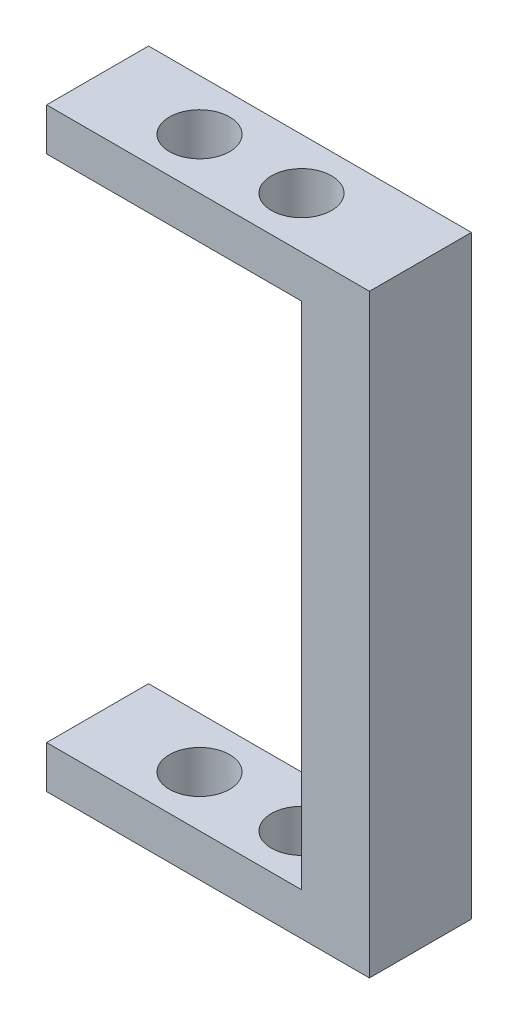
ISO-10303-21;
HEADER;
FILE_DESCRIPTION(('STEP AP214'),'2;1');
FILE_NAME('part.step','',(''),(''),'','','');
FILE_SCHEMA(('AUTOMOTIVE_DESIGN { 1 0 10303 214 1 1 1 1 }'));
ENDSEC;
DATA;
#1=APPLICATION_CONTEXT('core data for automotive mechanical design processes');
#2=APPLICATION_PROTOCOL_DEFINITION('international standard','automotive_design',2000,#1);
#3=PRODUCT_CONTEXT('',#1,'mechanical');
#4=PRODUCT('Part','Part','',(#3));
#5=PRODUCT_RELATED_PRODUCT_CATEGORY('part','',(#4));
#6=PRODUCT_DEFINITION_FORMATION('','',#4);
#7=PRODUCT_DEFINITION_CONTEXT('part definition',#1,'design');
#8=PRODUCT_DEFINITION('design','',#6,#7);
#9=PRODUCT_DEFINITION_SHAPE('','',#8);
#10=(LENGTH_UNIT() NAMED_UNIT(*) SI_UNIT(.MILLI.,.METRE.));
#11=(NAMED_UNIT(*) PLANE_ANGLE_UNIT() SI_UNIT($,.RADIAN.));
#12=(NAMED_UNIT(*) SI_UNIT($,.STERADIAN.) SOLID_ANGLE_UNIT());
#13=UNCERTAINTY_MEASURE_WITH_UNIT(LENGTH_MEASURE(1.E-05),#10,'distance_accuracy_value','');
#14=(GEOMETRIC_REPRESENTATION_CONTEXT(3) GLOBAL_UNCERTAINTY_ASSIGNED_CONTEXT((#13)) GLOBAL_UNIT_ASSIGNED_CONTEXT((#10,
#11,#12)) REPRESENTATION_CONTEXT('',''));
#15=CARTESIAN_POINT('',(0.,0.,0.));
#16=DIRECTION('',(0.,0.,1.));
#17=DIRECTION('',(1.,0.,0.));
#18=AXIS2_PLACEMENT_3D('',#15,#16,#17);
#19=CARTESIAN_POINT('',(0.,22.225,7.62));
#20=DIRECTION('',(0.,-1.,0.));
#21=DIRECTION('',(0.,0.,-1.));
#22=AXIS2_PLACEMENT_3D('',#19,#20,#21);
#23=PLANE('',#22);
#24=CARTESIAN_POINT('',(-13.97,22.225,3.81));
#25=DIRECTION('',(0.,1.,0.));
#26=DIRECTION('',(0.,0.,1.));
#27=AXIS2_PLACEMENT_3D('',#24,#25,#26);
#28=CIRCLE('',#27,2.25);
#29=CARTESIAN_POINT('',(-13.97,22.225,6.05999999999999));
#30=VERTEX_POINT('',#29);
#31=EDGE_CURVE('E235',#30,#30,#28,.T.);
#32=ORIENTED_EDGE('',*,*,#31,.F.);
#33=EDGE_LOOP('',(#32));
#34=FACE_BOUND('',#33,.T.);
#35=CARTESIAN_POINT('',(-6.35,22.225,3.81));
#36=DIRECTION('',(0.,1.,0.));
#37=DIRECTION('',(0.,0.,1.));
#38=AXIS2_PLACEMENT_3D('',#35,#36,#37);
#39=CIRCLE('',#38,2.25);
#40=CARTESIAN_POINT('',(-6.35,22.225,6.05999999999999));
#41=VERTEX_POINT('',#40);
#42=EDGE_CURVE('E219',#41,#41,#39,.T.);
#43=ORIENTED_EDGE('',*,*,#42,.F.);
#44=EDGE_LOOP('',(#43));
#45=FACE_BOUND('',#44,.T.);
#46=DIRECTION('',(-1.,0.,0.));
#47=VECTOR('',#46,1.);
#48=CARTESIAN_POINT('',(0.,22.225,0.));
#49=LINE('',#48,#47);
#50=CARTESIAN_POINT('',(2.54,22.225,0.));
#51=VERTEX_POINT('',#50);
#52=CARTESIAN_POINT('',(-21.59,22.225,0.));
#53=VERTEX_POINT('',#52);
#54=EDGE_CURVE('E144',#51,#53,#49,.T.);
#55=ORIENTED_EDGE('',*,*,#54,.T.);
#56=DIRECTION('',(0.,0.,-1.));
#57=VECTOR('',#56,1.);
#58=CARTESIAN_POINT('',(-21.59,22.225,7.62));
#59=LINE('',#58,#57);
#60=CARTESIAN_POINT('',(-21.59,22.225,7.62));
#61=VERTEX_POINT('',#60);
#62=EDGE_CURVE('E11',#61,#53,#59,.T.);
#63=ORIENTED_EDGE('',*,*,#62,.F.);
#64=DIRECTION('',(-1.,0.,0.));
#65=VECTOR('',#64,1.);
#66=CARTESIAN_POINT('',(0.,22.225,7.62));
#67=LINE('',#66,#65);
#68=CARTESIAN_POINT('',(2.54,22.225,7.62));
#69=VERTEX_POINT('',#68);
#70=EDGE_CURVE('E171',#69,#61,#67,.T.);
#71=ORIENTED_EDGE('',*,*,#70,.F.);
#72=DIRECTION('',(0.,0.,-1.));
#73=VECTOR('',#72,1.);
#74=CARTESIAN_POINT('',(2.54,22.225,7.62));
#75=LINE('',#74,#73);
#76=EDGE_CURVE('E143',#69,#51,#75,.T.);
#77=ORIENTED_EDGE('',*,*,#76,.T.);
#78=EDGE_LOOP('',(#55,#63,#71,#77));
#79=FACE_BOUND('',#78,.T.);
#80=ADVANCED_FACE('F40',(#34,#45,#79),#23,.F.);
#81=CARTESIAN_POINT('',(-21.59,0.,7.62));
#82=DIRECTION('',(1.,0.,0.));
#83=DIRECTION('',(0.,1.,0.));
#84=AXIS2_PLACEMENT_3D('',#81,#82,#83);
#85=PLANE('',#84);
#86=DIRECTION('',(0.,-1.,0.));
#87=VECTOR('',#86,1.);
#88=CARTESIAN_POINT('',(-21.59,0.,0.));
#89=LINE('',#88,#87);
#90=CARTESIAN_POINT('',(-21.59,19.05,0.));
#91=VERTEX_POINT('',#90);
#92=EDGE_CURVE('E148',#53,#91,#89,.T.);
#93=ORIENTED_EDGE('',*,*,#92,.T.);
#94=DIRECTION('',(0.,0.,-1.));
#95=VECTOR('',#94,1.);
#96=CARTESIAN_POINT('',(-21.59,19.05,7.62));
#97=LINE('',#96,#95);
#98=CARTESIAN_POINT('',(-21.59,19.05,7.62));
#99=VERTEX_POINT('',#98);
#100=EDGE_CURVE('E49',#99,#91,#97,.T.);
#101=ORIENTED_EDGE('',*,*,#100,.F.);
#102=DIRECTION('',(0.,-1.,0.));
#103=VECTOR('',#102,1.);
#104=CARTESIAN_POINT('',(-21.59,0.,7.62));
#105=LINE('',#104,#103);
#106=EDGE_CURVE('E99',#61,#99,#105,.T.);
#107=ORIENTED_EDGE('',*,*,#106,.F.);
#108=ORIENTED_EDGE('',*,*,#62,.T.);
#109=EDGE_LOOP('',(#93,#101,#107,#108));
#110=FACE_BOUND('',#109,.T.);
#111=ADVANCED_FACE('F190',(#110),#85,.F.);
#112=CARTESIAN_POINT('',(0.,19.05,7.62));
#113=DIRECTION('',(0.,-1.,0.));
#114=DIRECTION('',(1.,0.,0.));
#115=AXIS2_PLACEMENT_3D('',#112,#113,#114);
#116=PLANE('',#115);
#117=CARTESIAN_POINT('',(-13.97,19.05,3.81));
#118=DIRECTION('',(0.,-1.,0.));
#119=DIRECTION('',(1.,0.,0.));
#120=AXIS2_PLACEMENT_3D('',#117,#118,#119);
#121=CIRCLE('',#120,2.24999999999999);
#122=CARTESIAN_POINT('',(-11.72,19.05,3.81));
#123=VERTEX_POINT('',#122);
#124=EDGE_CURVE('E227',#123,#123,#121,.T.);
#125=ORIENTED_EDGE('',*,*,#124,.F.);
#126=EDGE_LOOP('',(#125));
#127=FACE_BOUND('',#126,.T.);
#128=CARTESIAN_POINT('',(-6.35,19.05,3.81));
#129=DIRECTION('',(0.,-1.,0.));
#130=DIRECTION('',(1.,0.,0.));
#131=AXIS2_PLACEMENT_3D('',#128,#129,#130);
#132=CIRCLE('',#131,2.24999999999999);
#133=CARTESIAN_POINT('',(-4.10000000000001,19.05,3.81));
#134=VERTEX_POINT('',#133);
#135=EDGE_CURVE('E211',#134,#134,#132,.T.);
#136=ORIENTED_EDGE('',*,*,#135,.F.);
#137=EDGE_LOOP('',(#136));
#138=FACE_BOUND('',#137,.T.);
#139=DIRECTION('',(-1.,0.,0.));
#140=VECTOR('',#139,1.);
#141=CARTESIAN_POINT('',(0.,19.05,0.));
#142=LINE('',#141,#140);
#143=CARTESIAN_POINT('',(-2.54,19.05,0.));
#144=VERTEX_POINT('',#143);
#145=EDGE_CURVE('E153',#144,#91,#142,.T.);
#146=ORIENTED_EDGE('',*,*,#145,.F.);
#147=DIRECTION('',(0.,0.,-1.));
#148=VECTOR('',#147,1.);
#149=CARTESIAN_POINT('',(-2.54,19.05,7.62));
#150=LINE('',#149,#148);
#151=CARTESIAN_POINT('',(-2.54,19.05,7.62));
#152=VERTEX_POINT('',#151);
#153=EDGE_CURVE('E181',#152,#144,#150,.T.);
#154=ORIENTED_EDGE('',*,*,#153,.F.);
#155=DIRECTION('',(-1.,0.,0.));
#156=VECTOR('',#155,1.);
#157=CARTESIAN_POINT('',(0.,19.05,7.62));
#158=LINE('',#157,#156);
#159=EDGE_CURVE('E189',#152,#99,#158,.T.);
#160=ORIENTED_EDGE('',*,*,#159,.T.);
#161=ORIENTED_EDGE('',*,*,#100,.T.);
#162=EDGE_LOOP('',(#146,#154,#160,#161));
#163=FACE_BOUND('',#162,.T.);
#164=ADVANCED_FACE('F187',(#127,#138,#163),#116,.T.);
#165=CARTESIAN_POINT('',(-2.54,0.,7.62));
#166=DIRECTION('',(-1.,0.,0.));
#167=DIRECTION('',(0.,-1.,0.));
#168=AXIS2_PLACEMENT_3D('',#165,#166,#167);
#169=PLANE('',#168);
#170=DIRECTION('',(0.,1.,0.));
#171=VECTOR('',#170,1.);
#172=CARTESIAN_POINT('',(-2.54,0.,0.));
#173=LINE('',#172,#171);
#174=CARTESIAN_POINT('',(-2.54,-19.05,0.));
#175=VERTEX_POINT('',#174);
#176=EDGE_CURVE('E157',#175,#144,#173,.T.);
#177=ORIENTED_EDGE('',*,*,#176,.F.);
#178=DIRECTION('',(0.,0.,-1.));
#179=VECTOR('',#178,1.);
#180=CARTESIAN_POINT('',(-2.54,-19.05,7.62));
#181=LINE('',#180,#179);
#182=CARTESIAN_POINT('',(-2.54,-19.05,7.62));
#183=VERTEX_POINT('',#182);
#184=EDGE_CURVE('E178',#183,#175,#181,.T.);
#185=ORIENTED_EDGE('',*,*,#184,.F.);
#186=DIRECTION('',(0.,1.,0.));
#187=VECTOR('',#186,1.);
#188=CARTESIAN_POINT('',(-2.54,0.,7.62));
#189=LINE('',#188,#187);
#190=EDGE_CURVE('E137',#183,#152,#189,.T.);
#191=ORIENTED_EDGE('',*,*,#190,.T.);
#192=ORIENTED_EDGE('',*,*,#153,.T.);
#193=EDGE_LOOP('',(#177,#185,#191,#192));
#194=FACE_BOUND('',#193,.T.);
#195=ADVANCED_FACE('F198',(#194),#169,.T.);
#196=CARTESIAN_POINT('',(0.,-19.05,7.62));
#197=DIRECTION('',(0.,-1.,0.));
#198=DIRECTION('',(1.,0.,0.));
#199=AXIS2_PLACEMENT_3D('',#196,#197,#198);
#200=PLANE('',#199);
#201=CARTESIAN_POINT('',(-13.97,-19.05,3.81));
#202=DIRECTION('',(0.,-1.,0.));
#203=DIRECTION('',(1.,0.,0.));
#204=AXIS2_PLACEMENT_3D('',#201,#202,#203);
#205=CIRCLE('',#204,2.24999999999999);
#206=CARTESIAN_POINT('',(-11.72,-19.05,3.81));
#207=VERTEX_POINT('',#206);
#208=EDGE_CURVE('E223',#207,#207,#205,.T.);
#209=ORIENTED_EDGE('',*,*,#208,.T.);
#210=EDGE_LOOP('',(#209));
#211=FACE_BOUND('',#210,.T.);
#212=CARTESIAN_POINT('',(-6.35,-19.05,3.81));
#213=DIRECTION('',(0.,-1.,0.));
#214=DIRECTION('',(1.,0.,0.));
#215=AXIS2_PLACEMENT_3D('',#212,#213,#214);
#216=CIRCLE('',#215,2.24999999999999);
#217=CARTESIAN_POINT('',(-4.10000000000001,-19.05,3.81));
#218=VERTEX_POINT('',#217);
#219=EDGE_CURVE('E149',#218,#218,#216,.T.);
#220=ORIENTED_EDGE('',*,*,#219,.T.);
#221=EDGE_LOOP('',(#220));
#222=FACE_BOUND('',#221,.T.);
#223=DIRECTION('',(-1.,0.,0.));
#224=VECTOR('',#223,1.);
#225=CARTESIAN_POINT('',(0.,-19.05,0.));
#226=LINE('',#225,#224);
#227=CARTESIAN_POINT('',(-21.59,-19.05,0.));
#228=VERTEX_POINT('',#227);
#229=EDGE_CURVE('E161',#175,#228,#226,.T.);
#230=ORIENTED_EDGE('',*,*,#229,.T.);
#231=DIRECTION('',(0.,0.,-1.));
#232=VECTOR('',#231,1.);
#233=CARTESIAN_POINT('',(-21.59,-19.05,7.62));
#234=LINE('',#233,#232);
#235=CARTESIAN_POINT('',(-21.59,-19.05,7.62));
#236=VERTEX_POINT('',#235);
#237=EDGE_CURVE('E122',#236,#228,#234,.T.);
#238=ORIENTED_EDGE('',*,*,#237,.F.);
#239=DIRECTION('',(-1.,0.,0.));
#240=VECTOR('',#239,1.);
#241=CARTESIAN_POINT('',(0.,-19.05,7.62));
#242=LINE('',#241,#240);
#243=EDGE_CURVE('E132',#183,#236,#242,.T.);
#244=ORIENTED_EDGE('',*,*,#243,.F.);
#245=ORIENTED_EDGE('',*,*,#184,.T.);
#246=EDGE_LOOP('',(#230,#238,#244,#245));
#247=FACE_BOUND('',#246,.T.);
#248=ADVANCED_FACE('F262',(#211,#222,#247),#200,.F.);
#249=CARTESIAN_POINT('',(-21.59,0.,7.62));
#250=DIRECTION('',(-1.,0.,0.));
#251=DIRECTION('',(0.,0.,1.));
#252=AXIS2_PLACEMENT_3D('',#249,#250,#251);
#253=PLANE('',#252);
#254=DIRECTION('',(0.,1.,0.));
#255=VECTOR('',#254,1.);
#256=CARTESIAN_POINT('',(-21.59,0.,0.));
#257=LINE('',#256,#255);
#258=CARTESIAN_POINT('',(-21.59,-22.225,0.));
#259=VERTEX_POINT('',#258);
#260=EDGE_CURVE('E120',#259,#228,#257,.T.);
#261=ORIENTED_EDGE('',*,*,#260,.F.);
#262=DIRECTION('',(0.,0.,-1.));
#263=VECTOR('',#262,1.);
#264=CARTESIAN_POINT('',(-21.59,-22.225,7.62));
#265=LINE('',#264,#263);
#266=CARTESIAN_POINT('',(-21.59,-22.225,7.62));
#267=VERTEX_POINT('',#266);
#268=EDGE_CURVE('E114',#267,#259,#265,.T.);
#269=ORIENTED_EDGE('',*,*,#268,.F.);
#270=DIRECTION('',(0.,1.,0.));
#271=VECTOR('',#270,1.);
#272=CARTESIAN_POINT('',(-21.59,0.,7.62));
#273=LINE('',#272,#271);
#274=EDGE_CURVE('E118',#267,#236,#273,.T.);
#275=ORIENTED_EDGE('',*,*,#274,.T.);
#276=ORIENTED_EDGE('',*,*,#237,.T.);
#277=EDGE_LOOP('',(#261,#269,#275,#276));
#278=FACE_BOUND('',#277,.T.);
#279=ADVANCED_FACE('F116',(#278),#253,.T.);
#280=CARTESIAN_POINT('',(0.,-22.225,7.62));
#281=DIRECTION('',(0.,1.,0.));
#282=DIRECTION('',(0.,0.,1.));
#283=AXIS2_PLACEMENT_3D('',#280,#281,#282);
#284=PLANE('',#283);
#285=CARTESIAN_POINT('',(-13.97,-22.225,3.81));
#286=DIRECTION('',(0.,1.,0.));
#287=DIRECTION('',(0.,0.,1.));
#288=AXIS2_PLACEMENT_3D('',#285,#286,#287);
#289=CIRCLE('',#288,2.24999999999999);
#290=CARTESIAN_POINT('',(-13.97,-22.225,6.05999999999999));
#291=VERTEX_POINT('',#290);
#292=EDGE_CURVE('E231',#291,#291,#289,.T.);
#293=ORIENTED_EDGE('',*,*,#292,.T.);
#294=EDGE_LOOP('',(#293));
#295=FACE_BOUND('',#294,.T.);
#296=CARTESIAN_POINT('',(-6.35,-22.225,3.81));
#297=DIRECTION('',(0.,1.,0.));
#298=DIRECTION('',(0.,0.,1.));
#299=AXIS2_PLACEMENT_3D('',#296,#297,#298);
#300=CIRCLE('',#299,2.24999999999999);
#301=CARTESIAN_POINT('',(-6.35,-22.225,6.05999999999999));
#302=VERTEX_POINT('',#301);
#303=EDGE_CURVE('E215',#302,#302,#300,.T.);
#304=ORIENTED_EDGE('',*,*,#303,.T.);
#305=EDGE_LOOP('',(#304));
#306=FACE_BOUND('',#305,.T.);
#307=DIRECTION('',(1.,0.,0.));
#308=VECTOR('',#307,1.);
#309=CARTESIAN_POINT('',(0.,-22.225,0.));
#310=LINE('',#309,#308);
#311=CARTESIAN_POINT('',(2.54,-22.225,0.));
#312=VERTEX_POINT('',#311);
#313=EDGE_CURVE('E85',#259,#312,#310,.T.);
#314=ORIENTED_EDGE('',*,*,#313,.T.);
#315=DIRECTION('',(0.,0.,-1.));
#316=VECTOR('',#315,1.);
#317=CARTESIAN_POINT('',(2.54,-22.225,7.62));
#318=LINE('',#317,#316);
#319=CARTESIAN_POINT('',(2.54,-22.225,7.62));
#320=VERTEX_POINT('',#319);
#321=EDGE_CURVE('E123',#320,#312,#318,.T.);
#322=ORIENTED_EDGE('',*,*,#321,.F.);
#323=DIRECTION('',(1.,0.,0.));
#324=VECTOR('',#323,1.);
#325=CARTESIAN_POINT('',(0.,-22.225,7.62));
#326=LINE('',#325,#324);
#327=EDGE_CURVE('E125',#267,#320,#326,.T.);
#328=ORIENTED_EDGE('',*,*,#327,.F.);
#329=ORIENTED_EDGE('',*,*,#268,.T.);
#330=EDGE_LOOP('',(#314,#322,#328,#329));
#331=FACE_BOUND('',#330,.T.);
#332=ADVANCED_FACE('F126',(#295,#306,#331),#284,.F.);
#333=CARTESIAN_POINT('',(2.54,0.,7.62));
#334=DIRECTION('',(-1.,0.,0.));
#335=DIRECTION('',(0.,0.,1.));
#336=AXIS2_PLACEMENT_3D('',#333,#334,#335);
#337=PLANE('',#336);
#338=DIRECTION('',(0.,1.,0.));
#339=VECTOR('',#338,1.);
#340=CARTESIAN_POINT('',(2.54,0.,0.));
#341=LINE('',#340,#339);
#342=EDGE_CURVE('E91',#312,#51,#341,.T.);
#343=ORIENTED_EDGE('',*,*,#342,.T.);
#344=ORIENTED_EDGE('',*,*,#76,.F.);
#345=DIRECTION('',(0.,1.,0.));
#346=VECTOR('',#345,1.);
#347=CARTESIAN_POINT('',(2.54,0.,7.62));
#348=LINE('',#347,#346);
#349=EDGE_CURVE('E57',#320,#69,#348,.T.);
#350=ORIENTED_EDGE('',*,*,#349,.F.);
#351=ORIENTED_EDGE('',*,*,#321,.T.);
#352=EDGE_LOOP('',(#343,#344,#350,#351));
#353=FACE_BOUND('',#352,.T.);
#354=ADVANCED_FACE('F247',(#353),#337,.F.);
#355=CARTESIAN_POINT('',(0.,0.,7.62));
#356=DIRECTION('',(0.,0.,1.));
#357=DIRECTION('',(1.,0.,0.));
#358=AXIS2_PLACEMENT_3D('',#355,#356,#357);
#359=PLANE('',#358);
#360=ORIENTED_EDGE('',*,*,#70,.T.);
#361=ORIENTED_EDGE('',*,*,#106,.T.);
#362=ORIENTED_EDGE('',*,*,#159,.F.);
#363=ORIENTED_EDGE('',*,*,#190,.F.);
#364=ORIENTED_EDGE('',*,*,#243,.T.);
#365=ORIENTED_EDGE('',*,*,#274,.F.);
#366=ORIENTED_EDGE('',*,*,#327,.T.);
#367=ORIENTED_EDGE('',*,*,#349,.T.);
#368=EDGE_LOOP('',(#360,#361,#362,#363,#364,#365,#366,#367));
#369=FACE_BOUND('',#368,.T.);
#370=ADVANCED_FACE('F129',(#369),#359,.T.);
#371=CARTESIAN_POINT('',(0.,0.,0.));
#372=DIRECTION('',(0.,0.,1.));
#373=DIRECTION('',(1.,0.,0.));
#374=AXIS2_PLACEMENT_3D('',#371,#372,#373);
#375=PLANE('',#374);
#376=ORIENTED_EDGE('',*,*,#54,.F.);
#377=ORIENTED_EDGE('',*,*,#342,.F.);
#378=ORIENTED_EDGE('',*,*,#313,.F.);
#379=ORIENTED_EDGE('',*,*,#260,.T.);
#380=ORIENTED_EDGE('',*,*,#229,.F.);
#381=ORIENTED_EDGE('',*,*,#176,.T.);
#382=ORIENTED_EDGE('',*,*,#145,.T.);
#383=ORIENTED_EDGE('',*,*,#92,.F.);
#384=EDGE_LOOP('',(#376,#377,#378,#379,#380,#381,#382,#383));
#385=FACE_BOUND('',#384,.T.);
#386=ADVANCED_FACE('F194',(#385),#375,.F.);
#387=CARTESIAN_POINT('',(-6.35,22.225,3.81));
#388=DIRECTION('',(0.,1.,0.));
#389=DIRECTION('',(0.,0.,1.));
#390=AXIS2_PLACEMENT_3D('',#387,#388,#389);
#391=CYLINDRICAL_SURFACE('',#390,2.24999999999999);
#392=ORIENTED_EDGE('',*,*,#303,.F.);
#393=EDGE_LOOP('',(#392));
#394=FACE_BOUND('',#393,.T.);
#395=ORIENTED_EDGE('',*,*,#219,.F.);
#396=EDGE_LOOP('',(#395));
#397=FACE_BOUND('',#396,.T.);
#398=ADVANCED_FACE('F307',(#394,#397),#391,.F.);
#399=ORIENTED_EDGE('',*,*,#135,.T.);
#400=EDGE_LOOP('',(#399));
#401=FACE_BOUND('',#400,.T.);
#402=ORIENTED_EDGE('',*,*,#42,.T.);
#403=EDGE_LOOP('',(#402));
#404=FACE_BOUND('',#403,.T.);
#405=ADVANCED_FACE('F312',(#401,#404),#391,.F.);
#406=CARTESIAN_POINT('',(-13.97,22.225,3.81));
#407=DIRECTION('',(0.,1.,0.));
#408=DIRECTION('',(0.,0.,1.));
#409=AXIS2_PLACEMENT_3D('',#406,#407,#408);
#410=CYLINDRICAL_SURFACE('',#409,2.24999999999999);
#411=ORIENTED_EDGE('',*,*,#124,.T.);
#412=EDGE_LOOP('',(#411));
#413=FACE_BOUND('',#412,.T.);
#414=ORIENTED_EDGE('',*,*,#31,.T.);
#415=EDGE_LOOP('',(#414));
#416=FACE_BOUND('',#415,.T.);
#417=ADVANCED_FACE('F240',(#413,#416),#410,.F.);
#418=ORIENTED_EDGE('',*,*,#292,.F.);
#419=EDGE_LOOP('',(#418));
#420=FACE_BOUND('',#419,.T.);
#421=ORIENTED_EDGE('',*,*,#208,.F.);
#422=EDGE_LOOP('',(#421));
#423=FACE_BOUND('',#422,.T.);
#424=ADVANCED_FACE('F332',(#420,#423),#410,.F.);
#425=CLOSED_SHELL('',(#80,#111,#164,#195,#248,#279,#332,#354,#370,#386,#398,#405,#417,#424));
#426=MANIFOLD_SOLID_BREP('B2',#425);
#427=ADVANCED_BREP_SHAPE_REPRESENTATION('',(#18,#426),#14);
#428=SHAPE_DEFINITION_REPRESENTATION(#9,#427);
ENDSEC;
END-ISO-10303-21;
